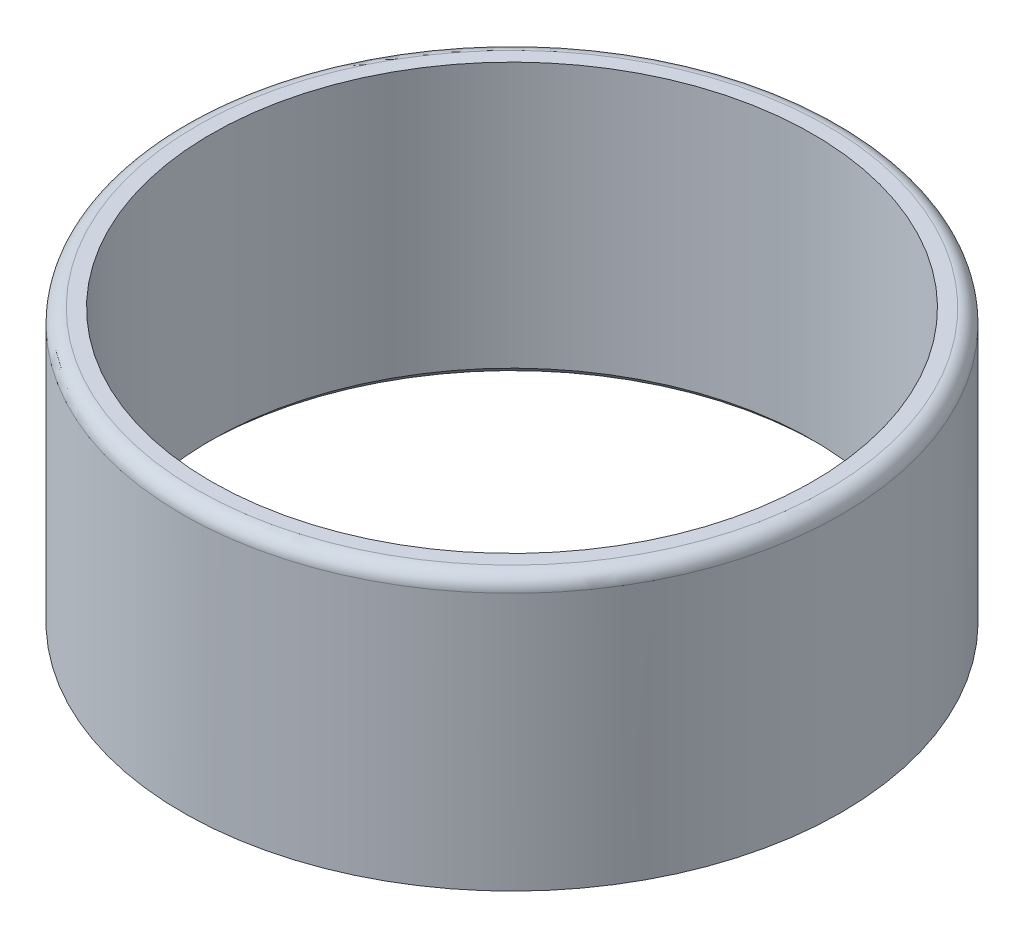
ISO-10303-21;
HEADER;
FILE_DESCRIPTION(('STEP AP214'),'2;1');
FILE_NAME('part.step','',(''),(''),'','','');
FILE_SCHEMA(('AUTOMOTIVE_DESIGN { 1 0 10303 214 1 1 1 1 }'));
ENDSEC;
DATA;
#1=APPLICATION_CONTEXT('core data for automotive mechanical design processes');
#2=APPLICATION_PROTOCOL_DEFINITION('international standard','automotive_design',2000,#1);
#3=PRODUCT_CONTEXT('',#1,'mechanical');
#4=PRODUCT('Part','Part','',(#3));
#5=PRODUCT_RELATED_PRODUCT_CATEGORY('part','',(#4));
#6=PRODUCT_DEFINITION_FORMATION('','',#4);
#7=PRODUCT_DEFINITION_CONTEXT('part definition',#1,'design');
#8=PRODUCT_DEFINITION('design','',#6,#7);
#9=PRODUCT_DEFINITION_SHAPE('','',#8);
#10=(LENGTH_UNIT() NAMED_UNIT(*) SI_UNIT(.MILLI.,.METRE.));
#11=(NAMED_UNIT(*) PLANE_ANGLE_UNIT() SI_UNIT($,.RADIAN.));
#12=(NAMED_UNIT(*) SI_UNIT($,.STERADIAN.) SOLID_ANGLE_UNIT());
#13=UNCERTAINTY_MEASURE_WITH_UNIT(LENGTH_MEASURE(1.E-05),#10,'distance_accuracy_value','');
#14=(GEOMETRIC_REPRESENTATION_CONTEXT(3) GLOBAL_UNCERTAINTY_ASSIGNED_CONTEXT((#13)) GLOBAL_UNIT_ASSIGNED_CONTEXT((#10,
#11,#12)) REPRESENTATION_CONTEXT('',''));
#15=CARTESIAN_POINT('',(0.,0.,0.));
#16=DIRECTION('',(0.,0.,1.));
#17=DIRECTION('',(1.,0.,0.));
#18=AXIS2_PLACEMENT_3D('',#15,#16,#17);
#19=CARTESIAN_POINT('',(0.,19.,0.));
#20=DIRECTION('',(0.,1.,0.));
#21=DIRECTION('',(0.,0.,1.));
#22=AXIS2_PLACEMENT_3D('',#19,#20,#21);
#23=PLANE('',#22);
#24=CARTESIAN_POINT('',(0.,19.,0.));
#25=DIRECTION('',(0.,1.,0.));
#26=DIRECTION('',(0.,0.,1.));
#27=AXIS2_PLACEMENT_3D('',#24,#25,#26);
#28=CIRCLE('',#27,22.);
#29=CARTESIAN_POINT('',(0.,19.,22.));
#30=VERTEX_POINT('',#29);
#31=EDGE_CURVE('E51',#30,#30,#28,.T.);
#32=ORIENTED_EDGE('',*,*,#31,.T.);
#33=EDGE_LOOP('',(#32));
#34=FACE_BOUND('',#33,.T.);
#35=CARTESIAN_POINT('',(0.,19.,0.));
#36=DIRECTION('',(0.,1.,0.));
#37=DIRECTION('',(0.,0.,1.));
#38=AXIS2_PLACEMENT_3D('',#35,#36,#37);
#39=CIRCLE('',#38,21.);
#40=CARTESIAN_POINT('',(0.,19.,21.));
#41=VERTEX_POINT('',#40);
#42=EDGE_CURVE('E59',#41,#41,#39,.T.);
#43=ORIENTED_EDGE('',*,*,#42,.F.);
#44=EDGE_LOOP('',(#43));
#45=FACE_BOUND('',#44,.T.);
#46=ADVANCED_FACE('F36',(#34,#45),#23,.T.);
#47=CARTESIAN_POINT('',(0.,0.,0.));
#48=DIRECTION('',(0.,1.,0.));
#49=DIRECTION('',(0.,0.,1.));
#50=AXIS2_PLACEMENT_3D('',#47,#48,#49);
#51=PLANE('',#50);
#52=CARTESIAN_POINT('',(0.,0.,0.));
#53=DIRECTION('',(0.,1.,0.));
#54=DIRECTION('',(0.,0.,1.));
#55=AXIS2_PLACEMENT_3D('',#52,#53,#54);
#56=CIRCLE('',#55,21.5);
#57=CARTESIAN_POINT('',(0.,0.,21.5));
#58=VERTEX_POINT('',#57);
#59=EDGE_CURVE('E43',#58,#58,#56,.T.);
#60=ORIENTED_EDGE('',*,*,#59,.T.);
#61=EDGE_LOOP('',(#60));
#62=FACE_BOUND('',#61,.T.);
#63=CARTESIAN_POINT('',(0.,0.,0.));
#64=DIRECTION('',(0.,1.,0.));
#65=DIRECTION('',(1.,0.,0.));
#66=AXIS2_PLACEMENT_3D('',#63,#64,#65);
#67=CIRCLE('',#66,23.);
#68=CARTESIAN_POINT('',(23.,0.,0.));
#69=VERTEX_POINT('',#68);
#70=EDGE_CURVE('E56',#69,#69,#67,.T.);
#71=ORIENTED_EDGE('',*,*,#70,.F.);
#72=EDGE_LOOP('',(#71));
#73=FACE_BOUND('',#72,.T.);
#74=ADVANCED_FACE('F66',(#62,#73),#51,.F.);
#75=CARTESIAN_POINT('',(0.,19.,0.));
#76=DIRECTION('',(0.,-1.,0.));
#77=DIRECTION('',(0.,0.,-1.));
#78=AXIS2_PLACEMENT_3D('',#75,#76,#77);
#79=CYLINDRICAL_SURFACE('',#78,23.);
#80=CARTESIAN_POINT('',(0.,18.,0.));
#81=DIRECTION('',(0.,1.,0.));
#82=DIRECTION('',(0.,0.,1.));
#83=AXIS2_PLACEMENT_3D('',#80,#81,#82);
#84=CIRCLE('',#83,23.);
#85=CARTESIAN_POINT('',(0.,18.,23.));
#86=VERTEX_POINT('',#85);
#87=EDGE_CURVE('E47',#86,#86,#84,.F.);
#88=ORIENTED_EDGE('',*,*,#87,.T.);
#89=EDGE_LOOP('',(#88));
#90=FACE_BOUND('',#89,.T.);
#91=ORIENTED_EDGE('',*,*,#70,.T.);
#92=EDGE_LOOP('',(#91));
#93=FACE_BOUND('',#92,.T.);
#94=ADVANCED_FACE('F72',(#90,#93),#79,.T.);
#95=CARTESIAN_POINT('',(0.,19.,0.));
#96=DIRECTION('',(0.,-1.,0.));
#97=DIRECTION('',(0.,0.,-1.));
#98=AXIS2_PLACEMENT_3D('',#95,#96,#97);
#99=CYLINDRICAL_SURFACE('',#98,21.);
#100=CARTESIAN_POINT('',(0.,0.500000000000004,0.));
#101=DIRECTION('',(0.,1.,0.));
#102=DIRECTION('',(0.,0.,1.));
#103=AXIS2_PLACEMENT_3D('',#100,#101,#102);
#104=CIRCLE('',#103,21.);
#105=CARTESIAN_POINT('',(0.,0.500000000000004,21.));
#106=VERTEX_POINT('',#105);
#107=EDGE_CURVE('E11',#106,#106,#104,.F.);
#108=ORIENTED_EDGE('',*,*,#107,.T.);
#109=EDGE_LOOP('',(#108));
#110=FACE_BOUND('',#109,.T.);
#111=ORIENTED_EDGE('',*,*,#42,.T.);
#112=EDGE_LOOP('',(#111));
#113=FACE_BOUND('',#112,.T.);
#114=ADVANCED_FACE('F63',(#110,#113),#99,.F.);
#115=CARTESIAN_POINT('',(0.,18.,0.));
#116=DIRECTION('',(0.,1.,0.));
#117=DIRECTION('',(0.,0.,1.));
#118=AXIS2_PLACEMENT_3D('',#115,#116,#117);
#119=TOROIDAL_SURFACE('',#118,22.,1.);
#120=ORIENTED_EDGE('',*,*,#87,.F.);
#121=EDGE_LOOP('',(#120));
#122=FACE_BOUND('',#121,.T.);
#123=ORIENTED_EDGE('',*,*,#31,.F.);
#124=EDGE_LOOP('',(#123));
#125=FACE_BOUND('',#124,.T.);
#126=ADVANCED_FACE('F78',(#122,#125),#119,.T.);
#127=CARTESIAN_POINT('',(0.,0.,0.));
#128=DIRECTION('',(0.,-1.,0.));
#129=DIRECTION('',(0.,0.,-1.));
#130=AXIS2_PLACEMENT_3D('',#127,#128,#129);
#131=CONICAL_SURFACE('',#130,21.5,0.785398163397445);
#132=ORIENTED_EDGE('',*,*,#107,.F.);
#133=EDGE_LOOP('',(#132));
#134=FACE_BOUND('',#133,.T.);
#135=ORIENTED_EDGE('',*,*,#59,.F.);
#136=EDGE_LOOP('',(#135));
#137=FACE_BOUND('',#136,.T.);
#138=ADVANCED_FACE('F38',(#134,#137),#131,.F.);
#139=CLOSED_SHELL('',(#46,#74,#94,#114,#126,#138));
#140=MANIFOLD_SOLID_BREP('B2',#139);
#141=ADVANCED_BREP_SHAPE_REPRESENTATION('',(#18,#140),#14);
#142=SHAPE_DEFINITION_REPRESENTATION(#9,#141);
ENDSEC;
END-ISO-10303-21;
